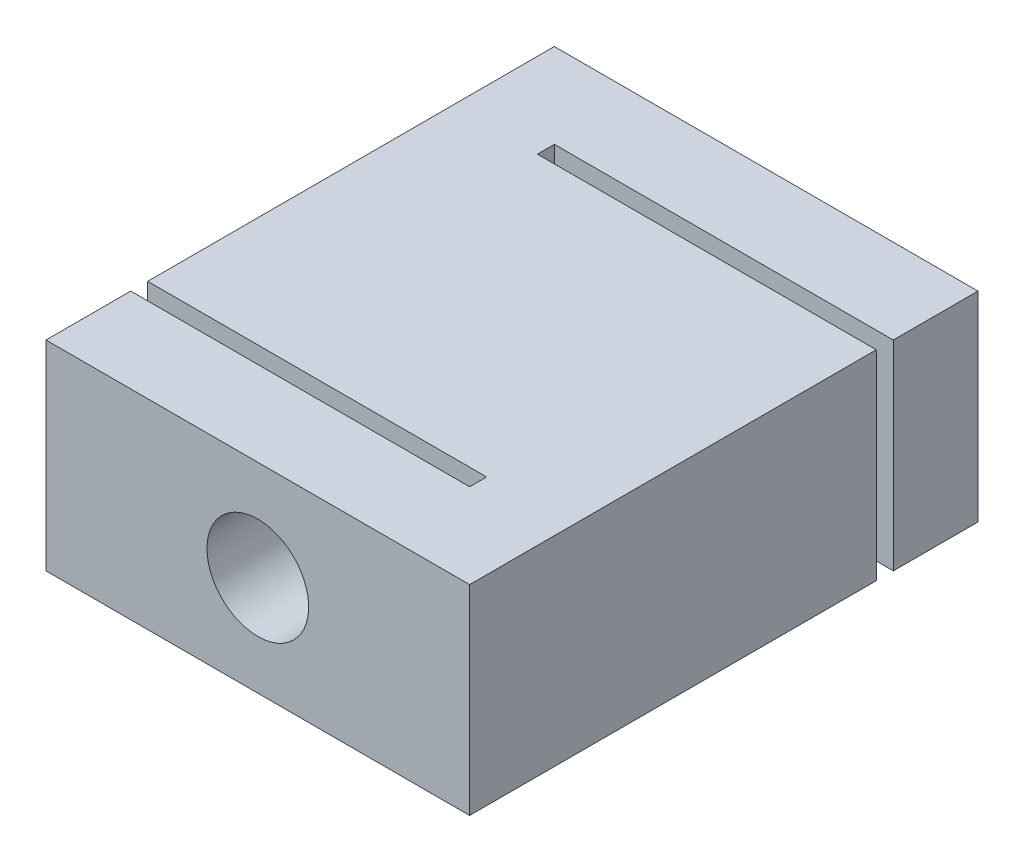
ISO-10303-21;
HEADER;
FILE_DESCRIPTION(('STEP AP214'),'2;1');
FILE_NAME('part.step','',(''),(''),'','','');
FILE_SCHEMA(('AUTOMOTIVE_DESIGN { 1 0 10303 214 1 1 1 1 }'));
ENDSEC;
DATA;
#1=APPLICATION_CONTEXT('core data for automotive mechanical design processes');
#2=APPLICATION_PROTOCOL_DEFINITION('international standard','automotive_design',2000,#1);
#3=PRODUCT_CONTEXT('',#1,'mechanical');
#4=PRODUCT('Part','Part','',(#3));
#5=PRODUCT_RELATED_PRODUCT_CATEGORY('part','',(#4));
#6=PRODUCT_DEFINITION_FORMATION('','',#4);
#7=PRODUCT_DEFINITION_CONTEXT('part definition',#1,'design');
#8=PRODUCT_DEFINITION('design','',#6,#7);
#9=PRODUCT_DEFINITION_SHAPE('','',#8);
#10=(LENGTH_UNIT() NAMED_UNIT(*) SI_UNIT(.MILLI.,.METRE.));
#11=(NAMED_UNIT(*) PLANE_ANGLE_UNIT() SI_UNIT($,.RADIAN.));
#12=(NAMED_UNIT(*) SI_UNIT($,.STERADIAN.) SOLID_ANGLE_UNIT());
#13=UNCERTAINTY_MEASURE_WITH_UNIT(LENGTH_MEASURE(1.E-05),#10,'distance_accuracy_value','');
#14=(GEOMETRIC_REPRESENTATION_CONTEXT(3) GLOBAL_UNCERTAINTY_ASSIGNED_CONTEXT((#13)) GLOBAL_UNIT_ASSIGNED_CONTEXT((#10,
#11,#12)) REPRESENTATION_CONTEXT('',''));
#15=CARTESIAN_POINT('',(0.,0.,0.));
#16=DIRECTION('',(0.,0.,1.));
#17=DIRECTION('',(1.,0.,0.));
#18=AXIS2_PLACEMENT_3D('',#15,#16,#17);
#19=CARTESIAN_POINT('',(0.,11.8,0.));
#20=DIRECTION('',(1.,0.,0.));
#21=DIRECTION('',(0.,0.,-1.));
#22=AXIS2_PLACEMENT_3D('',#19,#20,#21);
#23=PLANE('',#22);
#24=DIRECTION('',(0.,0.,1.));
#25=VECTOR('',#24,1.);
#26=CARTESIAN_POINT('',(0.,11.8,0.));
#27=LINE('',#26,#25);
#28=CARTESIAN_POINT('',(0.,11.8,-5.));
#29=VERTEX_POINT('',#28);
#30=CARTESIAN_POINT('',(0.,11.8,0.));
#31=VERTEX_POINT('',#30);
#32=EDGE_CURVE('E172',#29,#31,#27,.T.);
#33=ORIENTED_EDGE('',*,*,#32,.F.);
#34=DIRECTION('',(0.,1.,0.));
#35=VECTOR('',#34,1.);
#36=CARTESIAN_POINT('',(0.,-1.7,-5.));
#37=LINE('',#36,#35);
#38=CARTESIAN_POINT('',(0.,0.,-5.));
#39=VERTEX_POINT('',#38);
#40=EDGE_CURVE('E164',#39,#29,#37,.T.);
#41=ORIENTED_EDGE('',*,*,#40,.F.);
#42=DIRECTION('',(0.,0.,1.));
#43=VECTOR('',#42,1.);
#44=CARTESIAN_POINT('',(0.,0.,0.));
#45=LINE('',#44,#43);
#46=CARTESIAN_POINT('',(0.,0.,0.));
#47=VERTEX_POINT('',#46);
#48=EDGE_CURVE('E149',#39,#47,#45,.T.);
#49=ORIENTED_EDGE('',*,*,#48,.T.);
#50=DIRECTION('',(0.,-1.,0.));
#51=VECTOR('',#50,1.);
#52=CARTESIAN_POINT('',(0.,11.8,0.));
#53=LINE('',#52,#51);
#54=EDGE_CURVE('E198',#31,#47,#53,.T.);
#55=ORIENTED_EDGE('',*,*,#54,.F.);
#56=EDGE_LOOP('',(#33,#41,#49,#55));
#57=FACE_BOUND('',#56,.T.);
#58=ADVANCED_FACE('F33',(#57),#23,.F.);
#59=CARTESIAN_POINT('',(25.,11.8,0.));
#60=DIRECTION('',(-1.,0.,0.));
#61=DIRECTION('',(0.,0.,1.));
#62=AXIS2_PLACEMENT_3D('',#59,#60,#61);
#63=PLANE('',#62);
#64=DIRECTION('',(0.,0.,-1.));
#65=VECTOR('',#64,1.);
#66=CARTESIAN_POINT('',(25.,11.8,0.));
#67=LINE('',#66,#65);
#68=CARTESIAN_POINT('',(25.,11.8,-25.));
#69=VERTEX_POINT('',#68);
#70=CARTESIAN_POINT('',(25.,11.8,-30.));
#71=VERTEX_POINT('',#70);
#72=EDGE_CURVE('E174',#69,#71,#67,.T.);
#73=ORIENTED_EDGE('',*,*,#72,.F.);
#74=DIRECTION('',(0.,1.,0.));
#75=VECTOR('',#74,1.);
#76=CARTESIAN_POINT('',(25.,-1.7,-25.));
#77=LINE('',#76,#75);
#78=CARTESIAN_POINT('',(25.,0.,-25.));
#79=VERTEX_POINT('',#78);
#80=EDGE_CURVE('E150',#79,#69,#77,.T.);
#81=ORIENTED_EDGE('',*,*,#80,.F.);
#82=DIRECTION('',(0.,0.,-1.));
#83=VECTOR('',#82,1.);
#84=CARTESIAN_POINT('',(25.,0.,0.));
#85=LINE('',#84,#83);
#86=CARTESIAN_POINT('',(25.,0.,-30.));
#87=VERTEX_POINT('',#86);
#88=EDGE_CURVE('E184',#79,#87,#85,.T.);
#89=ORIENTED_EDGE('',*,*,#88,.T.);
#90=DIRECTION('',(0.,-1.,0.));
#91=VECTOR('',#90,1.);
#92=CARTESIAN_POINT('',(25.,11.8,-30.));
#93=LINE('',#92,#91);
#94=EDGE_CURVE('E192',#71,#87,#93,.T.);
#95=ORIENTED_EDGE('',*,*,#94,.F.);
#96=EDGE_LOOP('',(#73,#81,#89,#95));
#97=FACE_BOUND('',#96,.T.);
#98=ADVANCED_FACE('F220',(#97),#63,.F.);
#99=CARTESIAN_POINT('',(0.,0.,-30.));
#100=VERTEX_POINT('',#99);
#101=CARTESIAN_POINT('',(0.,0.,-6.));
#102=VERTEX_POINT('',#101);
#103=EDGE_CURVE('E179',#100,#102,#45,.T.);
#104=ORIENTED_EDGE('',*,*,#103,.T.);
#105=DIRECTION('',(0.,1.,0.));
#106=VECTOR('',#105,1.);
#107=CARTESIAN_POINT('',(0.,-1.7,-6.));
#108=LINE('',#107,#106);
#109=CARTESIAN_POINT('',(0.,11.8,-6.));
#110=VERTEX_POINT('',#109);
#111=EDGE_CURVE('E57',#102,#110,#108,.T.);
#112=ORIENTED_EDGE('',*,*,#111,.T.);
#113=CARTESIAN_POINT('',(0.,11.8,-30.));
#114=VERTEX_POINT('',#113);
#115=EDGE_CURVE('E168',#114,#110,#27,.T.);
#116=ORIENTED_EDGE('',*,*,#115,.F.);
#117=DIRECTION('',(0.,-1.,0.));
#118=VECTOR('',#117,1.);
#119=CARTESIAN_POINT('',(0.,11.8,-30.));
#120=LINE('',#119,#118);
#121=EDGE_CURVE('E178',#114,#100,#120,.T.);
#122=ORIENTED_EDGE('',*,*,#121,.T.);
#123=EDGE_LOOP('',(#104,#112,#116,#122));
#124=FACE_BOUND('',#123,.T.);
#125=ADVANCED_FACE('F35',(#124),#23,.F.);
#126=CARTESIAN_POINT('',(0.,11.8,0.));
#127=DIRECTION('',(0.,0.,-1.));
#128=DIRECTION('',(-1.,0.,0.));
#129=AXIS2_PLACEMENT_3D('',#126,#127,#128);
#130=PLANE('',#129);
#131=CARTESIAN_POINT('',(12.5,5.9,0.));
#132=DIRECTION('',(0.,0.,-1.));
#133=DIRECTION('',(-1.,0.,0.));
#134=AXIS2_PLACEMENT_3D('',#131,#132,#133);
#135=CIRCLE('',#134,3.);
#136=CARTESIAN_POINT('',(9.5,5.9,0.));
#137=VERTEX_POINT('',#136);
#138=EDGE_CURVE('E378',#137,#137,#135,.T.);
#139=ORIENTED_EDGE('',*,*,#138,.T.);
#140=EDGE_LOOP('',(#139));
#141=FACE_BOUND('',#140,.T.);
#142=DIRECTION('',(1.,0.,0.));
#143=VECTOR('',#142,1.);
#144=CARTESIAN_POINT('',(0.,0.,0.));
#145=LINE('',#144,#143);
#146=CARTESIAN_POINT('',(25.,0.,0.));
#147=VERTEX_POINT('',#146);
#148=EDGE_CURVE('E182',#47,#147,#145,.T.);
#149=ORIENTED_EDGE('',*,*,#148,.T.);
#150=DIRECTION('',(0.,-1.,0.));
#151=VECTOR('',#150,1.);
#152=CARTESIAN_POINT('',(25.,11.8,0.));
#153=LINE('',#152,#151);
#154=CARTESIAN_POINT('',(25.,11.8,0.));
#155=VERTEX_POINT('',#154);
#156=EDGE_CURVE('E195',#155,#147,#153,.T.);
#157=ORIENTED_EDGE('',*,*,#156,.F.);
#158=DIRECTION('',(1.,0.,0.));
#159=VECTOR('',#158,1.);
#160=CARTESIAN_POINT('',(0.,11.8,0.));
#161=LINE('',#160,#159);
#162=EDGE_CURVE('E171',#31,#155,#161,.T.);
#163=ORIENTED_EDGE('',*,*,#162,.F.);
#164=ORIENTED_EDGE('',*,*,#54,.T.);
#165=EDGE_LOOP('',(#149,#157,#163,#164));
#166=FACE_BOUND('',#165,.T.);
#167=ADVANCED_FACE('F246',(#141,#166),#130,.F.);
#168=CARTESIAN_POINT('',(25.,0.,-24.));
#169=VERTEX_POINT('',#168);
#170=EDGE_CURVE('E185',#147,#169,#85,.T.);
#171=ORIENTED_EDGE('',*,*,#170,.T.);
#172=DIRECTION('',(0.,1.,0.));
#173=VECTOR('',#172,1.);
#174=CARTESIAN_POINT('',(25.,-1.7,-24.));
#175=LINE('',#174,#173);
#176=CARTESIAN_POINT('',(25.,11.8,-24.));
#177=VERTEX_POINT('',#176);
#178=EDGE_CURVE('E49',#169,#177,#175,.T.);
#179=ORIENTED_EDGE('',*,*,#178,.T.);
#180=EDGE_CURVE('E143',#155,#177,#67,.T.);
#181=ORIENTED_EDGE('',*,*,#180,.F.);
#182=ORIENTED_EDGE('',*,*,#156,.T.);
#183=EDGE_LOOP('',(#171,#179,#181,#182));
#184=FACE_BOUND('',#183,.T.);
#185=ADVANCED_FACE('F250',(#184),#63,.F.);
#186=CARTESIAN_POINT('',(0.,11.8,-30.));
#187=DIRECTION('',(0.,0.,1.));
#188=DIRECTION('',(1.,0.,0.));
#189=AXIS2_PLACEMENT_3D('',#186,#187,#188);
#190=PLANE('',#189);
#191=CARTESIAN_POINT('',(12.5,5.9,-30.));
#192=DIRECTION('',(0.,0.,-1.));
#193=DIRECTION('',(-1.,0.,0.));
#194=AXIS2_PLACEMENT_3D('',#191,#192,#193);
#195=CIRCLE('',#194,3.);
#196=CARTESIAN_POINT('',(9.5,5.9,-30.));
#197=VERTEX_POINT('',#196);
#198=EDGE_CURVE('E387',#197,#197,#195,.T.);
#199=ORIENTED_EDGE('',*,*,#198,.F.);
#200=EDGE_LOOP('',(#199));
#201=FACE_BOUND('',#200,.T.);
#202=DIRECTION('',(-1.,0.,0.));
#203=VECTOR('',#202,1.);
#204=CARTESIAN_POINT('',(0.,0.,-30.));
#205=LINE('',#204,#203);
#206=EDGE_CURVE('E188',#87,#100,#205,.T.);
#207=ORIENTED_EDGE('',*,*,#206,.T.);
#208=ORIENTED_EDGE('',*,*,#121,.F.);
#209=DIRECTION('',(-1.,0.,0.));
#210=VECTOR('',#209,1.);
#211=CARTESIAN_POINT('',(0.,11.8,-30.));
#212=LINE('',#211,#210);
#213=EDGE_CURVE('E176',#71,#114,#212,.T.);
#214=ORIENTED_EDGE('',*,*,#213,.F.);
#215=ORIENTED_EDGE('',*,*,#94,.T.);
#216=EDGE_LOOP('',(#207,#208,#214,#215));
#217=FACE_BOUND('',#216,.T.);
#218=ADVANCED_FACE('F223',(#201,#217),#190,.F.);
#219=CARTESIAN_POINT('',(0.,11.8,0.));
#220=DIRECTION('',(0.,-1.,0.));
#221=DIRECTION('',(0.,0.,-1.));
#222=AXIS2_PLACEMENT_3D('',#219,#220,#221);
#223=PLANE('',#222);
#224=DIRECTION('',(0.,0.,1.));
#225=VECTOR('',#224,1.);
#226=CARTESIAN_POINT('',(5.,11.8,0.));
#227=LINE('',#226,#225);
#228=CARTESIAN_POINT('',(5.,11.8,-25.));
#229=VERTEX_POINT('',#228);
#230=CARTESIAN_POINT('',(5.,11.8,-24.));
#231=VERTEX_POINT('',#230);
#232=EDGE_CURVE('E131',#229,#231,#227,.T.);
#233=ORIENTED_EDGE('',*,*,#232,.F.);
#234=DIRECTION('',(-1.,0.,0.));
#235=VECTOR('',#234,1.);
#236=CARTESIAN_POINT('',(0.,11.8,-25.));
#237=LINE('',#236,#235);
#238=EDGE_CURVE('E128',#69,#229,#237,.T.);
#239=ORIENTED_EDGE('',*,*,#238,.F.);
#240=ORIENTED_EDGE('',*,*,#72,.T.);
#241=ORIENTED_EDGE('',*,*,#213,.T.);
#242=ORIENTED_EDGE('',*,*,#115,.T.);
#243=DIRECTION('',(-1.,0.,0.));
#244=VECTOR('',#243,1.);
#245=CARTESIAN_POINT('',(0.,11.8,-6.));
#246=LINE('',#245,#244);
#247=CARTESIAN_POINT('',(20.,11.8,-6.));
#248=VERTEX_POINT('',#247);
#249=EDGE_CURVE('E156',#248,#110,#246,.T.);
#250=ORIENTED_EDGE('',*,*,#249,.F.);
#251=DIRECTION('',(0.,0.,-1.));
#252=VECTOR('',#251,1.);
#253=CARTESIAN_POINT('',(20.,11.8,0.));
#254=LINE('',#253,#252);
#255=CARTESIAN_POINT('',(20.,11.8,-5.));
#256=VERTEX_POINT('',#255);
#257=EDGE_CURVE('E153',#256,#248,#254,.T.);
#258=ORIENTED_EDGE('',*,*,#257,.F.);
#259=DIRECTION('',(1.,0.,0.));
#260=VECTOR('',#259,1.);
#261=CARTESIAN_POINT('',(0.,11.8,-5.));
#262=LINE('',#261,#260);
#263=EDGE_CURVE('E159',#29,#256,#262,.T.);
#264=ORIENTED_EDGE('',*,*,#263,.F.);
#265=ORIENTED_EDGE('',*,*,#32,.T.);
#266=ORIENTED_EDGE('',*,*,#162,.T.);
#267=ORIENTED_EDGE('',*,*,#180,.T.);
#268=DIRECTION('',(1.,0.,0.));
#269=VECTOR('',#268,1.);
#270=CARTESIAN_POINT('',(0.,11.8,-24.));
#271=LINE('',#270,#269);
#272=EDGE_CURVE('E124',#231,#177,#271,.T.);
#273=ORIENTED_EDGE('',*,*,#272,.F.);
#274=EDGE_LOOP('',(#233,#239,#240,#241,#242,#250,#258,#264,#265,#266,#267,#273));
#275=FACE_BOUND('',#274,.T.);
#276=ADVANCED_FACE('F141',(#275),#223,.F.);
#277=CARTESIAN_POINT('',(0.,0.,0.));
#278=DIRECTION('',(0.,-1.,0.));
#279=DIRECTION('',(0.,0.,-1.));
#280=AXIS2_PLACEMENT_3D('',#277,#278,#279);
#281=PLANE('',#280);
#282=DIRECTION('',(1.,0.,0.));
#283=VECTOR('',#282,1.);
#284=CARTESIAN_POINT('',(0.,0.,-25.));
#285=LINE('',#284,#283);
#286=CARTESIAN_POINT('',(5.,0.,-25.));
#287=VERTEX_POINT('',#286);
#288=EDGE_CURVE('E11',#287,#79,#285,.T.);
#289=ORIENTED_EDGE('',*,*,#288,.F.);
#290=DIRECTION('',(0.,0.,-1.));
#291=VECTOR('',#290,1.);
#292=CARTESIAN_POINT('',(5.,0.,0.));
#293=LINE('',#292,#291);
#294=CARTESIAN_POINT('',(5.,0.,-24.));
#295=VERTEX_POINT('',#294);
#296=EDGE_CURVE('E42',#295,#287,#293,.T.);
#297=ORIENTED_EDGE('',*,*,#296,.F.);
#298=DIRECTION('',(-1.,0.,0.));
#299=VECTOR('',#298,1.);
#300=CARTESIAN_POINT('',(0.,0.,-24.));
#301=LINE('',#300,#299);
#302=EDGE_CURVE('E125',#169,#295,#301,.T.);
#303=ORIENTED_EDGE('',*,*,#302,.F.);
#304=ORIENTED_EDGE('',*,*,#170,.F.);
#305=ORIENTED_EDGE('',*,*,#148,.F.);
#306=ORIENTED_EDGE('',*,*,#48,.F.);
#307=DIRECTION('',(-1.,0.,0.));
#308=VECTOR('',#307,1.);
#309=CARTESIAN_POINT('',(0.,0.,-5.));
#310=LINE('',#309,#308);
#311=CARTESIAN_POINT('',(20.,0.,-5.));
#312=VERTEX_POINT('',#311);
#313=EDGE_CURVE('E205',#312,#39,#310,.T.);
#314=ORIENTED_EDGE('',*,*,#313,.F.);
#315=DIRECTION('',(0.,0.,1.));
#316=VECTOR('',#315,1.);
#317=CARTESIAN_POINT('',(20.,0.,0.));
#318=LINE('',#317,#316);
#319=CARTESIAN_POINT('',(20.,0.,-6.));
#320=VERTEX_POINT('',#319);
#321=EDGE_CURVE('E203',#320,#312,#318,.T.);
#322=ORIENTED_EDGE('',*,*,#321,.F.);
#323=DIRECTION('',(1.,0.,0.));
#324=VECTOR('',#323,1.);
#325=CARTESIAN_POINT('',(0.,0.,-6.));
#326=LINE('',#325,#324);
#327=EDGE_CURVE('E201',#102,#320,#326,.T.);
#328=ORIENTED_EDGE('',*,*,#327,.F.);
#329=ORIENTED_EDGE('',*,*,#103,.F.);
#330=ORIENTED_EDGE('',*,*,#206,.F.);
#331=ORIENTED_EDGE('',*,*,#88,.F.);
#332=EDGE_LOOP('',(#289,#297,#303,#304,#305,#306,#314,#322,#328,#329,#330,#331));
#333=FACE_BOUND('',#332,.T.);
#334=ADVANCED_FACE('F214',(#333),#281,.T.);
#335=CARTESIAN_POINT('',(20.,-1.7,0.));
#336=DIRECTION('',(1.,0.,0.));
#337=DIRECTION('',(0.,0.,-1.));
#338=AXIS2_PLACEMENT_3D('',#335,#336,#337);
#339=PLANE('',#338);
#340=ORIENTED_EDGE('',*,*,#321,.T.);
#341=DIRECTION('',(0.,1.,0.));
#342=VECTOR('',#341,1.);
#343=CARTESIAN_POINT('',(20.,-1.7,-5.));
#344=LINE('',#343,#342);
#345=EDGE_CURVE('E138',#312,#256,#344,.T.);
#346=ORIENTED_EDGE('',*,*,#345,.T.);
#347=ORIENTED_EDGE('',*,*,#257,.T.);
#348=DIRECTION('',(0.,1.,0.));
#349=VECTOR('',#348,1.);
#350=CARTESIAN_POINT('',(20.,-1.7,-6.));
#351=LINE('',#350,#349);
#352=EDGE_CURVE('E162',#320,#248,#351,.T.);
#353=ORIENTED_EDGE('',*,*,#352,.F.);
#354=EDGE_LOOP('',(#340,#346,#347,#353));
#355=FACE_BOUND('',#354,.T.);
#356=ADVANCED_FACE('F234',(#355),#339,.F.);
#357=CARTESIAN_POINT('',(0.,-1.7,-5.));
#358=DIRECTION('',(0.,0.,1.));
#359=DIRECTION('',(1.,0.,0.));
#360=AXIS2_PLACEMENT_3D('',#357,#358,#359);
#361=PLANE('',#360);
#362=CARTESIAN_POINT('',(12.5,5.9,-5.));
#363=DIRECTION('',(0.,0.,1.));
#364=DIRECTION('',(1.,0.,0.));
#365=AXIS2_PLACEMENT_3D('',#362,#363,#364);
#366=CIRCLE('',#365,3.);
#367=CARTESIAN_POINT('',(15.5,5.9,-5.));
#368=VERTEX_POINT('',#367);
#369=EDGE_CURVE('E157',#368,#368,#366,.T.);
#370=ORIENTED_EDGE('',*,*,#369,.T.);
#371=EDGE_LOOP('',(#370));
#372=FACE_BOUND('',#371,.T.);
#373=ORIENTED_EDGE('',*,*,#313,.T.);
#374=ORIENTED_EDGE('',*,*,#40,.T.);
#375=ORIENTED_EDGE('',*,*,#263,.T.);
#376=ORIENTED_EDGE('',*,*,#345,.F.);
#377=EDGE_LOOP('',(#373,#374,#375,#376));
#378=FACE_BOUND('',#377,.T.);
#379=ADVANCED_FACE('F251',(#372,#378),#361,.F.);
#380=CARTESIAN_POINT('',(0.,-1.7,-6.));
#381=DIRECTION('',(0.,0.,-1.));
#382=DIRECTION('',(-1.,0.,0.));
#383=AXIS2_PLACEMENT_3D('',#380,#381,#382);
#384=PLANE('',#383);
#385=CARTESIAN_POINT('',(12.5,5.9,-6.));
#386=DIRECTION('',(0.,0.,-1.));
#387=DIRECTION('',(-1.,0.,0.));
#388=AXIS2_PLACEMENT_3D('',#385,#386,#387);
#389=CIRCLE('',#388,3.);
#390=CARTESIAN_POINT('',(9.5,5.9,-6.));
#391=VERTEX_POINT('',#390);
#392=EDGE_CURVE('E380',#391,#391,#389,.T.);
#393=ORIENTED_EDGE('',*,*,#392,.T.);
#394=EDGE_LOOP('',(#393));
#395=FACE_BOUND('',#394,.T.);
#396=ORIENTED_EDGE('',*,*,#327,.T.);
#397=ORIENTED_EDGE('',*,*,#352,.T.);
#398=ORIENTED_EDGE('',*,*,#249,.T.);
#399=ORIENTED_EDGE('',*,*,#111,.F.);
#400=EDGE_LOOP('',(#396,#397,#398,#399));
#401=FACE_BOUND('',#400,.T.);
#402=ADVANCED_FACE('F232',(#395,#401),#384,.F.);
#403=CARTESIAN_POINT('',(5.,-1.7,0.));
#404=DIRECTION('',(-1.,0.,0.));
#405=DIRECTION('',(0.,0.,1.));
#406=AXIS2_PLACEMENT_3D('',#403,#404,#405);
#407=PLANE('',#406);
#408=ORIENTED_EDGE('',*,*,#296,.T.);
#409=DIRECTION('',(0.,1.,0.));
#410=VECTOR('',#409,1.);
#411=CARTESIAN_POINT('',(5.,-1.7,-25.));
#412=LINE('',#411,#410);
#413=EDGE_CURVE('E134',#287,#229,#412,.T.);
#414=ORIENTED_EDGE('',*,*,#413,.T.);
#415=ORIENTED_EDGE('',*,*,#232,.T.);
#416=DIRECTION('',(0.,1.,0.));
#417=VECTOR('',#416,1.);
#418=CARTESIAN_POINT('',(5.,-1.7,-24.));
#419=LINE('',#418,#417);
#420=EDGE_CURVE('E120',#295,#231,#419,.T.);
#421=ORIENTED_EDGE('',*,*,#420,.F.);
#422=EDGE_LOOP('',(#408,#414,#415,#421));
#423=FACE_BOUND('',#422,.T.);
#424=ADVANCED_FACE('F132',(#423),#407,.F.);
#425=CARTESIAN_POINT('',(0.,-1.7,-25.));
#426=DIRECTION('',(0.,0.,-1.));
#427=DIRECTION('',(-1.,0.,0.));
#428=AXIS2_PLACEMENT_3D('',#425,#426,#427);
#429=PLANE('',#428);
#430=CARTESIAN_POINT('',(12.5,5.9,-25.));
#431=DIRECTION('',(0.,0.,-1.));
#432=DIRECTION('',(-1.,0.,0.));
#433=AXIS2_PLACEMENT_3D('',#430,#431,#432);
#434=CIRCLE('',#433,3.);
#435=CARTESIAN_POINT('',(9.5,5.9,-25.));
#436=VERTEX_POINT('',#435);
#437=EDGE_CURVE('E382',#436,#436,#434,.T.);
#438=ORIENTED_EDGE('',*,*,#437,.T.);
#439=EDGE_LOOP('',(#438));
#440=FACE_BOUND('',#439,.T.);
#441=ORIENTED_EDGE('',*,*,#288,.T.);
#442=ORIENTED_EDGE('',*,*,#80,.T.);
#443=ORIENTED_EDGE('',*,*,#238,.T.);
#444=ORIENTED_EDGE('',*,*,#413,.F.);
#445=EDGE_LOOP('',(#441,#442,#443,#444));
#446=FACE_BOUND('',#445,.T.);
#447=ADVANCED_FACE('F211',(#440,#446),#429,.F.);
#448=CARTESIAN_POINT('',(0.,-1.7,-24.));
#449=DIRECTION('',(0.,0.,1.));
#450=DIRECTION('',(1.,0.,0.));
#451=AXIS2_PLACEMENT_3D('',#448,#449,#450);
#452=PLANE('',#451);
#453=CARTESIAN_POINT('',(12.5,5.9,-24.));
#454=DIRECTION('',(0.,0.,1.));
#455=DIRECTION('',(1.,0.,0.));
#456=AXIS2_PLACEMENT_3D('',#453,#454,#455);
#457=CIRCLE('',#456,3.);
#458=CARTESIAN_POINT('',(15.5,5.9,-24.));
#459=VERTEX_POINT('',#458);
#460=EDGE_CURVE('E37',#459,#459,#457,.T.);
#461=ORIENTED_EDGE('',*,*,#460,.T.);
#462=EDGE_LOOP('',(#461));
#463=FACE_BOUND('',#462,.T.);
#464=ORIENTED_EDGE('',*,*,#302,.T.);
#465=ORIENTED_EDGE('',*,*,#420,.T.);
#466=ORIENTED_EDGE('',*,*,#272,.T.);
#467=ORIENTED_EDGE('',*,*,#178,.F.);
#468=EDGE_LOOP('',(#464,#465,#466,#467));
#469=FACE_BOUND('',#468,.T.);
#470=ADVANCED_FACE('F122',(#463,#469),#452,.F.);
#471=CARTESIAN_POINT('',(12.5,5.9,0.));
#472=DIRECTION('',(0.,0.,-1.));
#473=DIRECTION('',(-1.,0.,0.));
#474=AXIS2_PLACEMENT_3D('',#471,#472,#473);
#475=CYLINDRICAL_SURFACE('',#474,3.);
#476=ORIENTED_EDGE('',*,*,#460,.F.);
#477=EDGE_LOOP('',(#476));
#478=FACE_BOUND('',#477,.T.);
#479=ORIENTED_EDGE('',*,*,#392,.F.);
#480=EDGE_LOOP('',(#479));
#481=FACE_BOUND('',#480,.T.);
#482=ADVANCED_FACE('F344',(#478,#481),#475,.F.);
#483=ORIENTED_EDGE('',*,*,#198,.T.);
#484=EDGE_LOOP('',(#483));
#485=FACE_BOUND('',#484,.T.);
#486=ORIENTED_EDGE('',*,*,#437,.F.);
#487=EDGE_LOOP('',(#486));
#488=FACE_BOUND('',#487,.T.);
#489=ADVANCED_FACE('F354',(#485,#488),#475,.F.);
#490=ORIENTED_EDGE('',*,*,#138,.F.);
#491=EDGE_LOOP('',(#490));
#492=FACE_BOUND('',#491,.T.);
#493=ORIENTED_EDGE('',*,*,#369,.F.);
#494=EDGE_LOOP('',(#493));
#495=FACE_BOUND('',#494,.T.);
#496=ADVANCED_FACE('F357',(#492,#495),#475,.F.);
#497=CLOSED_SHELL('',(#58,#98,#125,#167,#185,#218,#276,#334,#356,#379,#402,#424,#447,#470,#482,
#489,#496));
#498=MANIFOLD_SOLID_BREP('B2',#497);
#499=ADVANCED_BREP_SHAPE_REPRESENTATION('',(#18,#498),#14);
#500=SHAPE_DEFINITION_REPRESENTATION(#9,#499);
ENDSEC;
END-ISO-10303-21;
